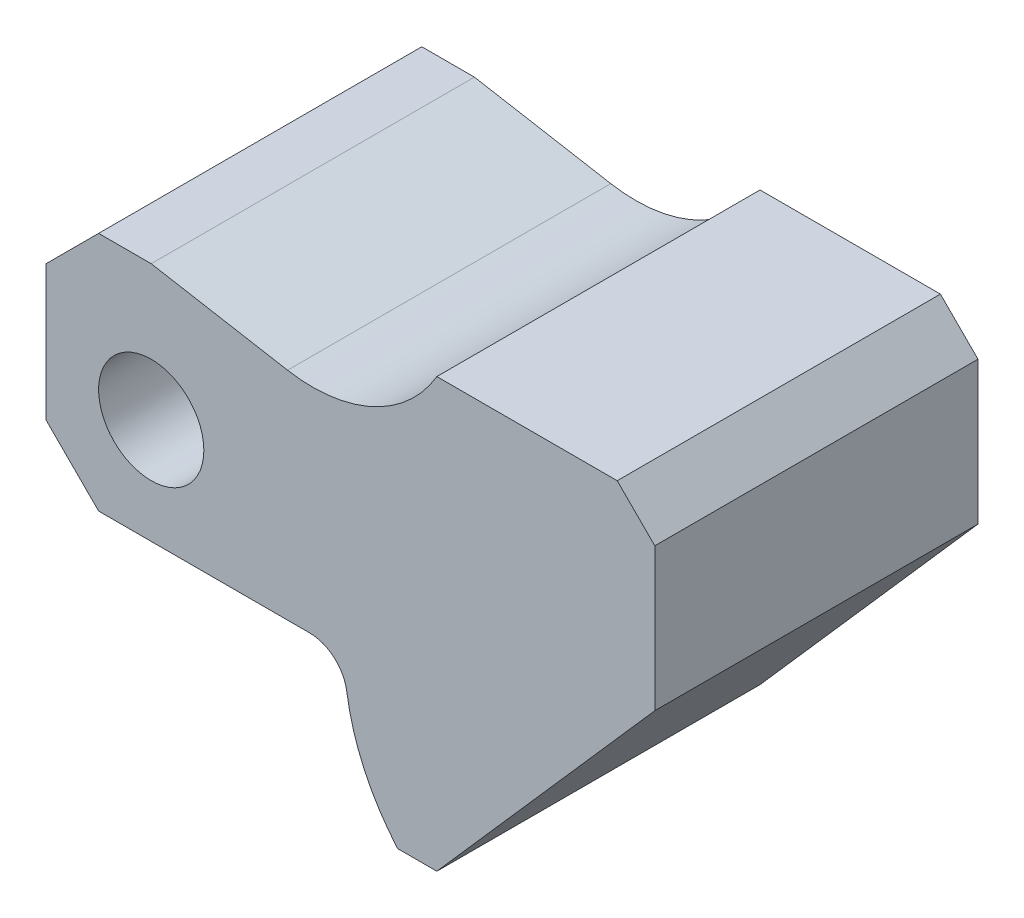
ISO-10303-21;
HEADER;
FILE_DESCRIPTION(('STEP AP214'),'2;1');
FILE_NAME('part.step','',(''),(''),'','','');
FILE_SCHEMA(('AUTOMOTIVE_DESIGN { 1 0 10303 214 1 1 1 1 }'));
ENDSEC;
DATA;
#1=APPLICATION_CONTEXT('core data for automotive mechanical design processes');
#2=APPLICATION_PROTOCOL_DEFINITION('international standard','automotive_design',2000,#1);
#3=PRODUCT_CONTEXT('',#1,'mechanical');
#4=PRODUCT('Part','Part','',(#3));
#5=PRODUCT_RELATED_PRODUCT_CATEGORY('part','',(#4));
#6=PRODUCT_DEFINITION_FORMATION('','',#4);
#7=PRODUCT_DEFINITION_CONTEXT('part definition',#1,'design');
#8=PRODUCT_DEFINITION('design','',#6,#7);
#9=PRODUCT_DEFINITION_SHAPE('','',#8);
#10=(LENGTH_UNIT() NAMED_UNIT(*) SI_UNIT(.MILLI.,.METRE.));
#11=(NAMED_UNIT(*) PLANE_ANGLE_UNIT() SI_UNIT($,.RADIAN.));
#12=(NAMED_UNIT(*) SI_UNIT($,.STERADIAN.) SOLID_ANGLE_UNIT());
#13=UNCERTAINTY_MEASURE_WITH_UNIT(LENGTH_MEASURE(1.E-05),#10,'distance_accuracy_value','');
#14=(GEOMETRIC_REPRESENTATION_CONTEXT(3) GLOBAL_UNCERTAINTY_ASSIGNED_CONTEXT((#13)) GLOBAL_UNIT_ASSIGNED_CONTEXT((#10,
#11,#12)) REPRESENTATION_CONTEXT('',''));
#15=CARTESIAN_POINT('',(0.,0.,0.));
#16=DIRECTION('',(0.,0.,1.));
#17=DIRECTION('',(1.,0.,0.));
#18=AXIS2_PLACEMENT_3D('',#15,#16,#17);
#19=CARTESIAN_POINT('',(68.6969696969697,0.,21.5));
#20=DIRECTION('',(0.,0.,1.));
#21=DIRECTION('',(1.,0.,0.));
#22=AXIS2_PLACEMENT_3D('',#19,#20,#21);
#23=PLANE('',#22);
#24=CARTESIAN_POINT('',(68.6969696969697,0.,21.5));
#25=DIRECTION('',(0.,0.,1.));
#26=DIRECTION('',(1.,0.,0.));
#27=AXIS2_PLACEMENT_3D('',#24,#25,#26);
#28=CIRCLE('',#27,29.);
#29=CARTESIAN_POINT('',(40.0122649967811,-4.26470588235294,21.5));
#30=VERTEX_POINT('',#29);
#31=CARTESIAN_POINT('',(46.7880673967631,-19.,21.5));
#32=VERTEX_POINT('',#31);
#33=EDGE_CURVE('E203',#30,#32,#28,.T.);
#34=ORIENTED_EDGE('',*,*,#33,.T.);
#35=DIRECTION('',(1.,0.,0.));
#36=VECTOR('',#35,1.);
#37=CARTESIAN_POINT('',(46.7880673967631,-19.,21.5));
#38=LINE('',#37,#36);
#39=CARTESIAN_POINT('',(52.,-19.,21.5));
#40=VERTEX_POINT('',#39);
#41=EDGE_CURVE('E121',#32,#40,#38,.T.);
#42=ORIENTED_EDGE('',*,*,#41,.T.);
#43=DIRECTION('',(0.660114607728679,0.751164898449876,0.));
#44=VECTOR('',#43,1.);
#45=CARTESIAN_POINT('',(52.,-19.,21.5));
#46=LINE('',#45,#44);
#47=CARTESIAN_POINT('',(81.,14.,21.5));
#48=VERTEX_POINT('',#47);
#49=EDGE_CURVE('E236',#40,#48,#46,.T.);
#50=ORIENTED_EDGE('',*,*,#49,.T.);
#51=DIRECTION('',(0.,1.,0.));
#52=VECTOR('',#51,1.);
#53=CARTESIAN_POINT('',(81.,14.,21.5));
#54=LINE('',#53,#52);
#55=CARTESIAN_POINT('',(81.,33.,21.5));
#56=VERTEX_POINT('',#55);
#57=EDGE_CURVE('E255',#48,#56,#54,.T.);
#58=ORIENTED_EDGE('',*,*,#57,.T.);
#59=DIRECTION('',(-0.707106781186546,0.707106781186549,0.));
#60=VECTOR('',#59,1.);
#61=CARTESIAN_POINT('',(81.,33.,21.5));
#62=LINE('',#61,#60);
#63=CARTESIAN_POINT('',(76.,38.,21.5));
#64=VERTEX_POINT('',#63);
#65=EDGE_CURVE('E252',#56,#64,#62,.T.);
#66=ORIENTED_EDGE('',*,*,#65,.T.);
#67=DIRECTION('',(-1.,0.,0.));
#68=VECTOR('',#67,1.);
#69=CARTESIAN_POINT('',(76.,38.,21.5));
#70=LINE('',#69,#68);
#71=CARTESIAN_POINT('',(52.,38.,21.5));
#72=VERTEX_POINT('',#71);
#73=EDGE_CURVE('E254',#64,#72,#70,.T.);
#74=ORIENTED_EDGE('',*,*,#73,.T.);
#75=CARTESIAN_POINT('',(35.4651456310637,47.6607989948613,21.5));
#76=DIRECTION('',(0.,0.,-1.));
#77=DIRECTION('',(-1.,0.,0.));
#78=AXIS2_PLACEMENT_3D('',#75,#76,#77);
#79=CIRCLE('',#78,19.1502596906947);
#80=CARTESIAN_POINT('',(32.1397379339261,28.801474779268,21.5));
#81=VERTEX_POINT('',#80);
#82=EDGE_CURVE('E257',#72,#81,#79,.T.);
#83=ORIENTED_EDGE('',*,*,#82,.T.);
#84=DIRECTION('',(-0.984807753012208,0.173648177666931,0.));
#85=VECTOR('',#84,1.);
#86=CARTESIAN_POINT('',(32.1397379339261,28.801474779268,21.5));
#87=LINE('',#86,#85);
#88=CARTESIAN_POINT('',(14.,32.,21.5));
#89=VERTEX_POINT('',#88);
#90=EDGE_CURVE('E263',#81,#89,#87,.T.);
#91=ORIENTED_EDGE('',*,*,#90,.T.);
#92=DIRECTION('',(-1.,0.,0.));
#93=VECTOR('',#92,1.);
#94=CARTESIAN_POINT('',(14.,32.,21.5));
#95=LINE('',#94,#93);
#96=CARTESIAN_POINT('',(7.,32.,21.5));
#97=VERTEX_POINT('',#96);
#98=EDGE_CURVE('E265',#89,#97,#95,.T.);
#99=ORIENTED_EDGE('',*,*,#98,.T.);
#100=DIRECTION('',(-0.707106781186549,-0.707106781186546,0.));
#101=VECTOR('',#100,1.);
#102=CARTESIAN_POINT('',(7.,32.,21.5));
#103=LINE('',#102,#101);
#104=CARTESIAN_POINT('',(0.,25.,21.5));
#105=VERTEX_POINT('',#104);
#106=EDGE_CURVE('E267',#97,#105,#103,.T.);
#107=ORIENTED_EDGE('',*,*,#106,.T.);
#108=DIRECTION('',(0.,-1.,0.));
#109=VECTOR('',#108,1.);
#110=CARTESIAN_POINT('',(0.,25.,21.5));
#111=LINE('',#110,#109);
#112=CARTESIAN_POINT('',(0.,7.,21.5));
#113=VERTEX_POINT('',#112);
#114=EDGE_CURVE('E158',#105,#113,#111,.T.);
#115=ORIENTED_EDGE('',*,*,#114,.T.);
#116=DIRECTION('',(0.707106781186546,-0.707106781186549,0.));
#117=VECTOR('',#116,1.);
#118=CARTESIAN_POINT('',(0.,7.,21.5));
#119=LINE('',#118,#117);
#120=CARTESIAN_POINT('',(6.99999999999998,0.,21.5));
#121=VERTEX_POINT('',#120);
#122=EDGE_CURVE('E152',#113,#121,#119,.T.);
#123=ORIENTED_EDGE('',*,*,#122,.T.);
#124=DIRECTION('',(1.,0.,0.));
#125=VECTOR('',#124,1.);
#126=CARTESIAN_POINT('',(6.99999999999998,0.,21.5));
#127=LINE('',#126,#125);
#128=CARTESIAN_POINT('',(35.0666262553693,0.,21.5));
#129=VERTEX_POINT('',#128);
#130=EDGE_CURVE('E156',#121,#129,#127,.T.);
#131=ORIENTED_EDGE('',*,*,#130,.T.);
#132=CARTESIAN_POINT('',(35.0666262553693,-5.,21.5));
#133=DIRECTION('',(0.,0.,-1.));
#134=DIRECTION('',(-1.,0.,0.));
#135=AXIS2_PLACEMENT_3D('',#132,#133,#134);
#136=CIRCLE('',#135,5.);
#137=EDGE_CURVE('E60',#129,#30,#136,.T.);
#138=ORIENTED_EDGE('',*,*,#137,.T.);
#139=EDGE_LOOP('',(#34,#42,#50,#58,#66,#74,#83,#91,#99,#107,#115,#123,#131,#138));
#140=FACE_BOUND('',#139,.T.);
#141=CARTESIAN_POINT('',(14.,14.,21.5));
#142=DIRECTION('',(0.,0.,1.));
#143=DIRECTION('',(1.,0.,0.));
#144=AXIS2_PLACEMENT_3D('',#141,#142,#143);
#145=CIRCLE('',#144,7.);
#146=CARTESIAN_POINT('',(21.,14.,21.5));
#147=VERTEX_POINT('',#146);
#148=EDGE_CURVE('E180',#147,#147,#145,.T.);
#149=ORIENTED_EDGE('',*,*,#148,.F.);
#150=EDGE_LOOP('',(#149));
#151=FACE_BOUND('',#150,.T.);
#152=ADVANCED_FACE('F43',(#140,#151),#23,.T.);
#153=CARTESIAN_POINT('',(68.6969696969697,0.,-21.5));
#154=DIRECTION('',(0.,0.,1.));
#155=DIRECTION('',(1.,0.,0.));
#156=AXIS2_PLACEMENT_3D('',#153,#154,#155);
#157=PLANE('',#156);
#158=CARTESIAN_POINT('',(68.6969696969697,0.,-21.5));
#159=DIRECTION('',(0.,0.,1.));
#160=DIRECTION('',(1.,0.,0.));
#161=AXIS2_PLACEMENT_3D('',#158,#159,#160);
#162=CIRCLE('',#161,29.);
#163=CARTESIAN_POINT('',(40.0122649967811,-4.26470588235294,-21.5));
#164=VERTEX_POINT('',#163);
#165=CARTESIAN_POINT('',(46.7880673967631,-19.,-21.5));
#166=VERTEX_POINT('',#165);
#167=EDGE_CURVE('E176',#164,#166,#162,.T.);
#168=ORIENTED_EDGE('',*,*,#167,.F.);
#169=CARTESIAN_POINT('',(35.0666262553693,-5.,-21.5));
#170=DIRECTION('',(0.,0.,-1.));
#171=DIRECTION('',(-1.,0.,0.));
#172=AXIS2_PLACEMENT_3D('',#169,#170,#171);
#173=CIRCLE('',#172,5.);
#174=CARTESIAN_POINT('',(35.0666262553693,0.,-21.5));
#175=VERTEX_POINT('',#174);
#176=EDGE_CURVE('E113',#175,#164,#173,.T.);
#177=ORIENTED_EDGE('',*,*,#176,.F.);
#178=DIRECTION('',(1.,0.,0.));
#179=VECTOR('',#178,1.);
#180=CARTESIAN_POINT('',(6.99999999999998,0.,-21.5));
#181=LINE('',#180,#179);
#182=CARTESIAN_POINT('',(6.99999999999998,0.,-21.5));
#183=VERTEX_POINT('',#182);
#184=EDGE_CURVE('E107',#183,#175,#181,.T.);
#185=ORIENTED_EDGE('',*,*,#184,.F.);
#186=DIRECTION('',(0.707106781186546,-0.707106781186549,0.));
#187=VECTOR('',#186,1.);
#188=CARTESIAN_POINT('',(0.,7.,-21.5));
#189=LINE('',#188,#187);
#190=CARTESIAN_POINT('',(0.,7.,-21.5));
#191=VERTEX_POINT('',#190);
#192=EDGE_CURVE('E166',#191,#183,#189,.T.);
#193=ORIENTED_EDGE('',*,*,#192,.F.);
#194=DIRECTION('',(0.,-1.,0.));
#195=VECTOR('',#194,1.);
#196=CARTESIAN_POINT('',(0.,25.,-21.5));
#197=LINE('',#196,#195);
#198=CARTESIAN_POINT('',(0.,25.,-21.5));
#199=VERTEX_POINT('',#198);
#200=EDGE_CURVE('E198',#199,#191,#197,.T.);
#201=ORIENTED_EDGE('',*,*,#200,.F.);
#202=DIRECTION('',(-0.707106781186549,-0.707106781186546,0.));
#203=VECTOR('',#202,1.);
#204=CARTESIAN_POINT('',(7.,32.,-21.5));
#205=LINE('',#204,#203);
#206=CARTESIAN_POINT('',(7.,32.,-21.5));
#207=VERTEX_POINT('',#206);
#208=EDGE_CURVE('E196',#207,#199,#205,.T.);
#209=ORIENTED_EDGE('',*,*,#208,.F.);
#210=DIRECTION('',(-1.,0.,0.));
#211=VECTOR('',#210,1.);
#212=CARTESIAN_POINT('',(14.,32.,-21.5));
#213=LINE('',#212,#211);
#214=CARTESIAN_POINT('',(14.,32.,-21.5));
#215=VERTEX_POINT('',#214);
#216=EDGE_CURVE('E194',#215,#207,#213,.T.);
#217=ORIENTED_EDGE('',*,*,#216,.F.);
#218=DIRECTION('',(-0.984807753012208,0.173648177666931,0.));
#219=VECTOR('',#218,1.);
#220=CARTESIAN_POINT('',(32.1397379339261,28.801474779268,-21.5));
#221=LINE('',#220,#219);
#222=CARTESIAN_POINT('',(32.1397379339261,28.801474779268,-21.5));
#223=VERTEX_POINT('',#222);
#224=EDGE_CURVE('E192',#223,#215,#221,.T.);
#225=ORIENTED_EDGE('',*,*,#224,.F.);
#226=CARTESIAN_POINT('',(35.4651456310637,47.6607989948613,-21.5));
#227=DIRECTION('',(0.,0.,-1.));
#228=DIRECTION('',(-1.,0.,0.));
#229=AXIS2_PLACEMENT_3D('',#226,#227,#228);
#230=CIRCLE('',#229,19.1502596906947);
#231=CARTESIAN_POINT('',(52.,38.,-21.5));
#232=VERTEX_POINT('',#231);
#233=EDGE_CURVE('E190',#232,#223,#230,.T.);
#234=ORIENTED_EDGE('',*,*,#233,.F.);
#235=DIRECTION('',(-1.,0.,0.));
#236=VECTOR('',#235,1.);
#237=CARTESIAN_POINT('',(76.,38.,-21.5));
#238=LINE('',#237,#236);
#239=CARTESIAN_POINT('',(76.,38.,-21.5));
#240=VERTEX_POINT('',#239);
#241=EDGE_CURVE('E188',#240,#232,#238,.T.);
#242=ORIENTED_EDGE('',*,*,#241,.F.);
#243=DIRECTION('',(-0.707106781186546,0.707106781186549,0.));
#244=VECTOR('',#243,1.);
#245=CARTESIAN_POINT('',(81.,33.,-21.5));
#246=LINE('',#245,#244);
#247=CARTESIAN_POINT('',(81.,33.,-21.5));
#248=VERTEX_POINT('',#247);
#249=EDGE_CURVE('E186',#248,#240,#246,.T.);
#250=ORIENTED_EDGE('',*,*,#249,.F.);
#251=DIRECTION('',(0.,1.,0.));
#252=VECTOR('',#251,1.);
#253=CARTESIAN_POINT('',(81.,14.,-21.5));
#254=LINE('',#253,#252);
#255=CARTESIAN_POINT('',(81.,14.,-21.5));
#256=VERTEX_POINT('',#255);
#257=EDGE_CURVE('E184',#256,#248,#254,.T.);
#258=ORIENTED_EDGE('',*,*,#257,.F.);
#259=DIRECTION('',(0.660114607728679,0.751164898449876,0.));
#260=VECTOR('',#259,1.);
#261=CARTESIAN_POINT('',(52.,-19.,-21.5));
#262=LINE('',#261,#260);
#263=CARTESIAN_POINT('',(52.,-19.,-21.5));
#264=VERTEX_POINT('',#263);
#265=EDGE_CURVE('E182',#264,#256,#262,.T.);
#266=ORIENTED_EDGE('',*,*,#265,.F.);
#267=DIRECTION('',(1.,0.,0.));
#268=VECTOR('',#267,1.);
#269=CARTESIAN_POINT('',(46.7880673967631,-19.,-21.5));
#270=LINE('',#269,#268);
#271=EDGE_CURVE('E179',#166,#264,#270,.T.);
#272=ORIENTED_EDGE('',*,*,#271,.F.);
#273=EDGE_LOOP('',(#168,#177,#185,#193,#201,#209,#217,#225,#234,#242,#250,#258,#266,#272));
#274=FACE_BOUND('',#273,.T.);
#275=CARTESIAN_POINT('',(14.,14.,-21.5));
#276=DIRECTION('',(0.,0.,1.));
#277=DIRECTION('',(1.,0.,0.));
#278=AXIS2_PLACEMENT_3D('',#275,#276,#277);
#279=CIRCLE('',#278,7.);
#280=CARTESIAN_POINT('',(21.,14.,-21.5));
#281=VERTEX_POINT('',#280);
#282=EDGE_CURVE('E508',#281,#281,#279,.T.);
#283=ORIENTED_EDGE('',*,*,#282,.T.);
#284=EDGE_LOOP('',(#283));
#285=FACE_BOUND('',#284,.T.);
#286=ADVANCED_FACE('F240',(#274,#285),#157,.F.);
#287=CARTESIAN_POINT('',(68.6969696969697,0.,21.5));
#288=DIRECTION('',(0.,0.,-1.));
#289=DIRECTION('',(-1.,0.,0.));
#290=AXIS2_PLACEMENT_3D('',#287,#288,#289);
#291=CYLINDRICAL_SURFACE('',#290,29.);
#292=ORIENTED_EDGE('',*,*,#167,.T.);
#293=DIRECTION('',(0.,0.,-1.));
#294=VECTOR('',#293,1.);
#295=CARTESIAN_POINT('',(46.7880673967631,-19.,21.5));
#296=LINE('',#295,#294);
#297=EDGE_CURVE('E11',#32,#166,#296,.T.);
#298=ORIENTED_EDGE('',*,*,#297,.F.);
#299=ORIENTED_EDGE('',*,*,#33,.F.);
#300=DIRECTION('',(0.,0.,-1.));
#301=VECTOR('',#300,1.);
#302=CARTESIAN_POINT('',(40.0122649967811,-4.26470588235294,21.5));
#303=LINE('',#302,#301);
#304=EDGE_CURVE('E172',#30,#164,#303,.T.);
#305=ORIENTED_EDGE('',*,*,#304,.T.);
#306=EDGE_LOOP('',(#292,#298,#299,#305));
#307=FACE_BOUND('',#306,.T.);
#308=ADVANCED_FACE('F45',(#307),#291,.T.);
#309=CARTESIAN_POINT('',(46.7880673967631,-19.,21.5));
#310=DIRECTION('',(0.,1.,0.));
#311=DIRECTION('',(-1.,0.,0.));
#312=AXIS2_PLACEMENT_3D('',#309,#310,#311);
#313=PLANE('',#312);
#314=ORIENTED_EDGE('',*,*,#271,.T.);
#315=DIRECTION('',(0.,0.,-1.));
#316=VECTOR('',#315,1.);
#317=CARTESIAN_POINT('',(52.,-19.,21.5));
#318=LINE('',#317,#316);
#319=EDGE_CURVE('E52',#40,#264,#318,.T.);
#320=ORIENTED_EDGE('',*,*,#319,.F.);
#321=ORIENTED_EDGE('',*,*,#41,.F.);
#322=ORIENTED_EDGE('',*,*,#297,.T.);
#323=EDGE_LOOP('',(#314,#320,#321,#322));
#324=FACE_BOUND('',#323,.T.);
#325=ADVANCED_FACE('F301',(#324),#313,.F.);
#326=CARTESIAN_POINT('',(52.,-19.,21.5));
#327=DIRECTION('',(-0.751164898449876,0.660114607728679,0.));
#328=DIRECTION('',(-0.660114607728679,-0.751164898449876,0.));
#329=AXIS2_PLACEMENT_3D('',#326,#327,#328);
#330=PLANE('',#329);
#331=ORIENTED_EDGE('',*,*,#265,.T.);
#332=DIRECTION('',(0.,0.,-1.));
#333=VECTOR('',#332,1.);
#334=CARTESIAN_POINT('',(81.,14.,21.5));
#335=LINE('',#334,#333);
#336=EDGE_CURVE('E228',#48,#256,#335,.T.);
#337=ORIENTED_EDGE('',*,*,#336,.F.);
#338=ORIENTED_EDGE('',*,*,#49,.F.);
#339=ORIENTED_EDGE('',*,*,#319,.T.);
#340=EDGE_LOOP('',(#331,#337,#338,#339));
#341=FACE_BOUND('',#340,.T.);
#342=ADVANCED_FACE('F234',(#341),#330,.F.);
#343=CARTESIAN_POINT('',(81.,14.,21.5));
#344=DIRECTION('',(-1.,0.,0.));
#345=DIRECTION('',(0.,0.,1.));
#346=AXIS2_PLACEMENT_3D('',#343,#344,#345);
#347=PLANE('',#346);
#348=ORIENTED_EDGE('',*,*,#257,.T.);
#349=DIRECTION('',(0.,0.,-1.));
#350=VECTOR('',#349,1.);
#351=CARTESIAN_POINT('',(81.,33.,21.5));
#352=LINE('',#351,#350);
#353=EDGE_CURVE('E225',#56,#248,#352,.T.);
#354=ORIENTED_EDGE('',*,*,#353,.F.);
#355=ORIENTED_EDGE('',*,*,#57,.F.);
#356=ORIENTED_EDGE('',*,*,#336,.T.);
#357=EDGE_LOOP('',(#348,#354,#355,#356));
#358=FACE_BOUND('',#357,.T.);
#359=ADVANCED_FACE('F246',(#358),#347,.F.);
#360=CARTESIAN_POINT('',(81.,33.,21.5));
#361=DIRECTION('',(-0.707106781186549,-0.707106781186546,0.));
#362=DIRECTION('',(0.707106781186546,-0.707106781186549,0.));
#363=AXIS2_PLACEMENT_3D('',#360,#361,#362);
#364=PLANE('',#363);
#365=ORIENTED_EDGE('',*,*,#249,.T.);
#366=DIRECTION('',(0.,0.,-1.));
#367=VECTOR('',#366,1.);
#368=CARTESIAN_POINT('',(76.,38.,21.5));
#369=LINE('',#368,#367);
#370=EDGE_CURVE('E222',#64,#240,#369,.T.);
#371=ORIENTED_EDGE('',*,*,#370,.F.);
#372=ORIENTED_EDGE('',*,*,#65,.F.);
#373=ORIENTED_EDGE('',*,*,#353,.T.);
#374=EDGE_LOOP('',(#365,#371,#372,#373));
#375=FACE_BOUND('',#374,.T.);
#376=ADVANCED_FACE('F250',(#375),#364,.F.);
#377=CARTESIAN_POINT('',(76.,38.,21.5));
#378=DIRECTION('',(0.,-1.,0.));
#379=DIRECTION('',(0.,0.,-1.));
#380=AXIS2_PLACEMENT_3D('',#377,#378,#379);
#381=PLANE('',#380);
#382=ORIENTED_EDGE('',*,*,#241,.T.);
#383=DIRECTION('',(0.,0.,-1.));
#384=VECTOR('',#383,1.);
#385=CARTESIAN_POINT('',(52.,38.,21.5));
#386=LINE('',#385,#384);
#387=EDGE_CURVE('E219',#72,#232,#386,.T.);
#388=ORIENTED_EDGE('',*,*,#387,.F.);
#389=ORIENTED_EDGE('',*,*,#73,.F.);
#390=ORIENTED_EDGE('',*,*,#370,.T.);
#391=EDGE_LOOP('',(#382,#388,#389,#390));
#392=FACE_BOUND('',#391,.T.);
#393=ADVANCED_FACE('F314',(#392),#381,.F.);
#394=CARTESIAN_POINT('',(35.4651456310637,47.6607989948613,21.5));
#395=DIRECTION('',(0.,0.,-1.));
#396=DIRECTION('',(-1.,0.,0.));
#397=AXIS2_PLACEMENT_3D('',#394,#395,#396);
#398=CYLINDRICAL_SURFACE('',#397,19.1502596906947);
#399=ORIENTED_EDGE('',*,*,#233,.T.);
#400=DIRECTION('',(0.,0.,-1.));
#401=VECTOR('',#400,1.);
#402=CARTESIAN_POINT('',(32.1397379339261,28.801474779268,21.5));
#403=LINE('',#402,#401);
#404=EDGE_CURVE('E216',#81,#223,#403,.T.);
#405=ORIENTED_EDGE('',*,*,#404,.F.);
#406=ORIENTED_EDGE('',*,*,#82,.F.);
#407=ORIENTED_EDGE('',*,*,#387,.T.);
#408=EDGE_LOOP('',(#399,#405,#406,#407));
#409=FACE_BOUND('',#408,.T.);
#410=ADVANCED_FACE('F317',(#409),#398,.F.);
#411=CARTESIAN_POINT('',(32.1397379339261,28.801474779268,21.5));
#412=DIRECTION('',(-0.173648177666931,-0.984807753012208,0.));
#413=DIRECTION('',(0.984807753012208,-0.173648177666931,0.));
#414=AXIS2_PLACEMENT_3D('',#411,#412,#413);
#415=PLANE('',#414);
#416=ORIENTED_EDGE('',*,*,#224,.T.);
#417=DIRECTION('',(0.,0.,-1.));
#418=VECTOR('',#417,1.);
#419=CARTESIAN_POINT('',(14.,32.,21.5));
#420=LINE('',#419,#418);
#421=EDGE_CURVE('E213',#89,#215,#420,.T.);
#422=ORIENTED_EDGE('',*,*,#421,.F.);
#423=ORIENTED_EDGE('',*,*,#90,.F.);
#424=ORIENTED_EDGE('',*,*,#404,.T.);
#425=EDGE_LOOP('',(#416,#422,#423,#424));
#426=FACE_BOUND('',#425,.T.);
#427=ADVANCED_FACE('F321',(#426),#415,.F.);
#428=CARTESIAN_POINT('',(14.,32.,21.5));
#429=DIRECTION('',(0.,-1.,0.));
#430=DIRECTION('',(0.,0.,-1.));
#431=AXIS2_PLACEMENT_3D('',#428,#429,#430);
#432=PLANE('',#431);
#433=ORIENTED_EDGE('',*,*,#216,.T.);
#434=DIRECTION('',(0.,0.,-1.));
#435=VECTOR('',#434,1.);
#436=CARTESIAN_POINT('',(7.,32.,21.5));
#437=LINE('',#436,#435);
#438=EDGE_CURVE('E210',#97,#207,#437,.T.);
#439=ORIENTED_EDGE('',*,*,#438,.F.);
#440=ORIENTED_EDGE('',*,*,#98,.F.);
#441=ORIENTED_EDGE('',*,*,#421,.T.);
#442=EDGE_LOOP('',(#433,#439,#440,#441));
#443=FACE_BOUND('',#442,.T.);
#444=ADVANCED_FACE('F325',(#443),#432,.F.);
#445=CARTESIAN_POINT('',(7.,32.,21.5));
#446=DIRECTION('',(0.707106781186546,-0.707106781186549,0.));
#447=DIRECTION('',(0.707106781186549,0.707106781186546,0.));
#448=AXIS2_PLACEMENT_3D('',#445,#446,#447);
#449=PLANE('',#448);
#450=ORIENTED_EDGE('',*,*,#208,.T.);
#451=DIRECTION('',(0.,0.,-1.));
#452=VECTOR('',#451,1.);
#453=CARTESIAN_POINT('',(0.,25.,21.5));
#454=LINE('',#453,#452);
#455=EDGE_CURVE('E207',#105,#199,#454,.T.);
#456=ORIENTED_EDGE('',*,*,#455,.F.);
#457=ORIENTED_EDGE('',*,*,#106,.F.);
#458=ORIENTED_EDGE('',*,*,#438,.T.);
#459=EDGE_LOOP('',(#450,#456,#457,#458));
#460=FACE_BOUND('',#459,.T.);
#461=ADVANCED_FACE('F273',(#460),#449,.F.);
#462=CARTESIAN_POINT('',(0.,25.,21.5));
#463=DIRECTION('',(1.,0.,0.));
#464=DIRECTION('',(0.,0.,-1.));
#465=AXIS2_PLACEMENT_3D('',#462,#463,#464);
#466=PLANE('',#465);
#467=ORIENTED_EDGE('',*,*,#200,.T.);
#468=DIRECTION('',(0.,0.,-1.));
#469=VECTOR('',#468,1.);
#470=CARTESIAN_POINT('',(0.,7.,21.5));
#471=LINE('',#470,#469);
#472=EDGE_CURVE('E167',#113,#191,#471,.T.);
#473=ORIENTED_EDGE('',*,*,#472,.F.);
#474=ORIENTED_EDGE('',*,*,#114,.F.);
#475=ORIENTED_EDGE('',*,*,#455,.T.);
#476=EDGE_LOOP('',(#467,#473,#474,#475));
#477=FACE_BOUND('',#476,.T.);
#478=ADVANCED_FACE('F277',(#477),#466,.F.);
#479=CARTESIAN_POINT('',(0.,7.,21.5));
#480=DIRECTION('',(0.707106781186549,0.707106781186546,0.));
#481=DIRECTION('',(-0.707106781186546,0.707106781186549,0.));
#482=AXIS2_PLACEMENT_3D('',#479,#480,#481);
#483=PLANE('',#482);
#484=ORIENTED_EDGE('',*,*,#192,.T.);
#485=DIRECTION('',(0.,0.,-1.));
#486=VECTOR('',#485,1.);
#487=CARTESIAN_POINT('',(6.99999999999998,0.,21.5));
#488=LINE('',#487,#486);
#489=EDGE_CURVE('E163',#121,#183,#488,.T.);
#490=ORIENTED_EDGE('',*,*,#489,.F.);
#491=ORIENTED_EDGE('',*,*,#122,.F.);
#492=ORIENTED_EDGE('',*,*,#472,.T.);
#493=EDGE_LOOP('',(#484,#490,#491,#492));
#494=FACE_BOUND('',#493,.T.);
#495=ADVANCED_FACE('F164',(#494),#483,.F.);
#496=CARTESIAN_POINT('',(6.99999999999998,0.,21.5));
#497=DIRECTION('',(0.,1.,0.));
#498=DIRECTION('',(0.,0.,1.));
#499=AXIS2_PLACEMENT_3D('',#496,#497,#498);
#500=PLANE('',#499);
#501=ORIENTED_EDGE('',*,*,#184,.T.);
#502=DIRECTION('',(0.,0.,-1.));
#503=VECTOR('',#502,1.);
#504=CARTESIAN_POINT('',(35.0666262553693,0.,21.5));
#505=LINE('',#504,#503);
#506=EDGE_CURVE('E168',#129,#175,#505,.T.);
#507=ORIENTED_EDGE('',*,*,#506,.F.);
#508=ORIENTED_EDGE('',*,*,#130,.F.);
#509=ORIENTED_EDGE('',*,*,#489,.T.);
#510=EDGE_LOOP('',(#501,#507,#508,#509));
#511=FACE_BOUND('',#510,.T.);
#512=ADVANCED_FACE('F170',(#511),#500,.F.);
#513=CARTESIAN_POINT('',(35.0666262553693,-5.,21.5));
#514=DIRECTION('',(0.,0.,-1.));
#515=DIRECTION('',(-1.,0.,0.));
#516=AXIS2_PLACEMENT_3D('',#513,#514,#515);
#517=CYLINDRICAL_SURFACE('',#516,5.);
#518=ORIENTED_EDGE('',*,*,#176,.T.);
#519=ORIENTED_EDGE('',*,*,#304,.F.);
#520=ORIENTED_EDGE('',*,*,#137,.F.);
#521=ORIENTED_EDGE('',*,*,#506,.T.);
#522=EDGE_LOOP('',(#518,#519,#520,#521));
#523=FACE_BOUND('',#522,.T.);
#524=ADVANCED_FACE('F281',(#523),#517,.F.);
#525=CARTESIAN_POINT('',(14.,14.,21.5));
#526=DIRECTION('',(0.,0.,-1.));
#527=DIRECTION('',(-1.,0.,0.));
#528=AXIS2_PLACEMENT_3D('',#525,#526,#527);
#529=CYLINDRICAL_SURFACE('',#528,7.);
#530=ORIENTED_EDGE('',*,*,#148,.T.);
#531=EDGE_LOOP('',(#530));
#532=FACE_BOUND('',#531,.T.);
#533=ORIENTED_EDGE('',*,*,#282,.F.);
#534=EDGE_LOOP('',(#533));
#535=FACE_BOUND('',#534,.T.);
#536=ADVANCED_FACE('F283',(#532,#535),#529,.F.);
#537=CLOSED_SHELL('',(#152,#286,#308,#325,#342,#359,#376,#393,#410,#427,#444,#461,#478,#495,
#512,#524,#536));
#538=MANIFOLD_SOLID_BREP('B2',#537);
#539=ADVANCED_BREP_SHAPE_REPRESENTATION('',(#18,#538),#14);
#540=SHAPE_DEFINITION_REPRESENTATION(#9,#539);
ENDSEC;
END-ISO-10303-21;
